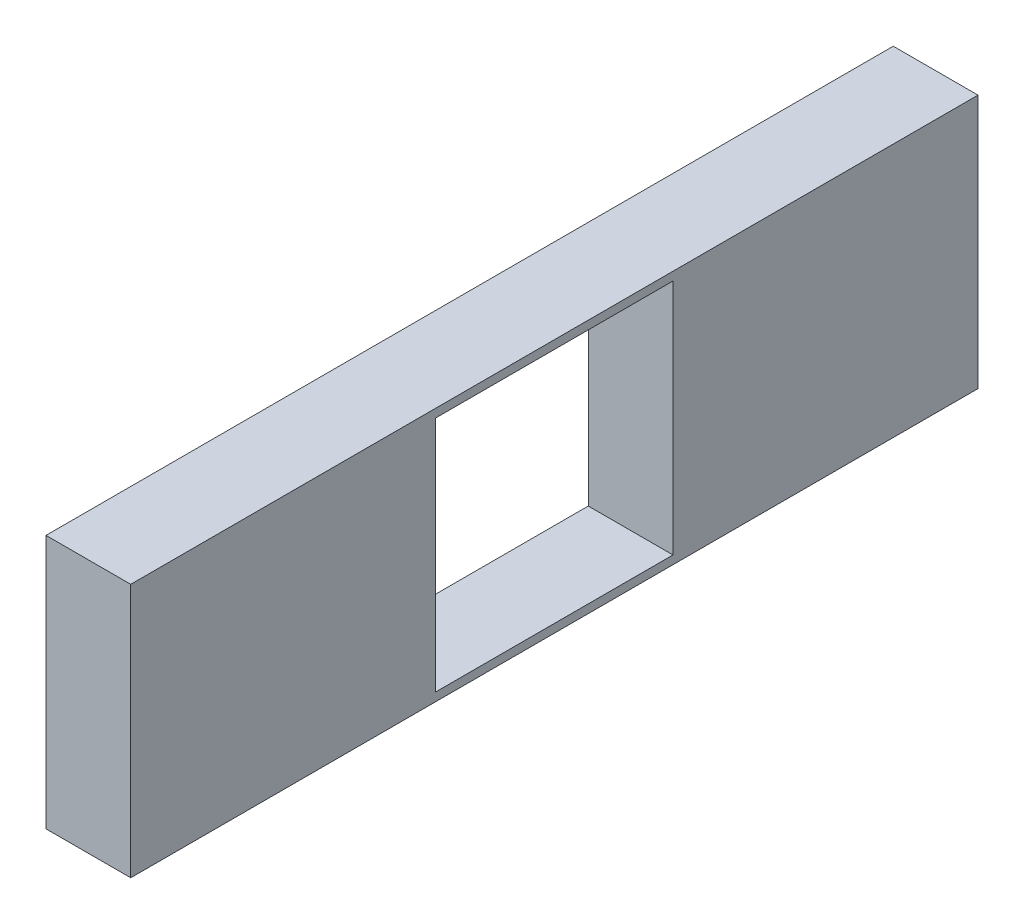
ISO-10303-21;
HEADER;
FILE_DESCRIPTION(('STEP AP214'),'2;1');
FILE_NAME('part.step','',(''),(''),'','','');
FILE_SCHEMA(('AUTOMOTIVE_DESIGN { 1 0 10303 214 1 1 1 1 }'));
ENDSEC;
DATA;
#1=APPLICATION_CONTEXT('core data for automotive mechanical design processes');
#2=APPLICATION_PROTOCOL_DEFINITION('international standard','automotive_design',2000,#1);
#3=PRODUCT_CONTEXT('',#1,'mechanical');
#4=PRODUCT('Part','Part','',(#3));
#5=PRODUCT_RELATED_PRODUCT_CATEGORY('part','',(#4));
#6=PRODUCT_DEFINITION_FORMATION('','',#4);
#7=PRODUCT_DEFINITION_CONTEXT('part definition',#1,'design');
#8=PRODUCT_DEFINITION('design','',#6,#7);
#9=PRODUCT_DEFINITION_SHAPE('','',#8);
#10=(LENGTH_UNIT() NAMED_UNIT(*) SI_UNIT(.MILLI.,.METRE.));
#11=(NAMED_UNIT(*) PLANE_ANGLE_UNIT() SI_UNIT($,.RADIAN.));
#12=(NAMED_UNIT(*) SI_UNIT($,.STERADIAN.) SOLID_ANGLE_UNIT());
#13=UNCERTAINTY_MEASURE_WITH_UNIT(LENGTH_MEASURE(1.E-05),#10,'distance_accuracy_value','');
#14=(GEOMETRIC_REPRESENTATION_CONTEXT(3) GLOBAL_UNCERTAINTY_ASSIGNED_CONTEXT((#13)) GLOBAL_UNIT_ASSIGNED_CONTEXT((#10,
#11,#12)) REPRESENTATION_CONTEXT('',''));
#15=CARTESIAN_POINT('',(0.,0.,0.));
#16=DIRECTION('',(0.,0.,1.));
#17=DIRECTION('',(1.,0.,0.));
#18=AXIS2_PLACEMENT_3D('',#15,#16,#17);
#19=CARTESIAN_POINT('',(5.,0.,0.));
#20=DIRECTION('',(0.,1.,0.));
#21=DIRECTION('',(0.,0.,1.));
#22=AXIS2_PLACEMENT_3D('',#19,#20,#21);
#23=PLANE('',#22);
#24=DIRECTION('',(0.,0.,-1.));
#25=VECTOR('',#24,1.);
#26=CARTESIAN_POINT('',(0.,0.,0.));
#27=LINE('',#26,#25);
#28=CARTESIAN_POINT('',(0.,0.,0.));
#29=VERTEX_POINT('',#28);
#30=CARTESIAN_POINT('',(0.,0.,-50.));
#31=VERTEX_POINT('',#30);
#32=EDGE_CURVE('E142',#29,#31,#27,.T.);
#33=ORIENTED_EDGE('',*,*,#32,.T.);
#34=DIRECTION('',(-1.,0.,0.));
#35=VECTOR('',#34,1.);
#36=CARTESIAN_POINT('',(5.,0.,-50.));
#37=LINE('',#36,#35);
#38=CARTESIAN_POINT('',(5.,0.,-50.));
#39=VERTEX_POINT('',#38);
#40=EDGE_CURVE('E11',#39,#31,#37,.T.);
#41=ORIENTED_EDGE('',*,*,#40,.F.);
#42=DIRECTION('',(0.,0.,-1.));
#43=VECTOR('',#42,1.);
#44=CARTESIAN_POINT('',(5.,0.,0.));
#45=LINE('',#44,#43);
#46=CARTESIAN_POINT('',(5.,0.,0.));
#47=VERTEX_POINT('',#46);
#48=EDGE_CURVE('E114',#47,#39,#45,.T.);
#49=ORIENTED_EDGE('',*,*,#48,.F.);
#50=DIRECTION('',(-1.,0.,0.));
#51=VECTOR('',#50,1.);
#52=CARTESIAN_POINT('',(5.,0.,0.));
#53=LINE('',#52,#51);
#54=EDGE_CURVE('E54',#47,#29,#53,.T.);
#55=ORIENTED_EDGE('',*,*,#54,.T.);
#56=EDGE_LOOP('',(#33,#41,#49,#55));
#57=FACE_BOUND('',#56,.T.);
#58=ADVANCED_FACE('F35',(#57),#23,.F.);
#59=CARTESIAN_POINT('',(5.,0.,-50.));
#60=DIRECTION('',(0.,0.,1.));
#61=DIRECTION('',(0.,-1.,0.));
#62=AXIS2_PLACEMENT_3D('',#59,#60,#61);
#63=PLANE('',#62);
#64=DIRECTION('',(0.,1.,0.));
#65=VECTOR('',#64,1.);
#66=CARTESIAN_POINT('',(0.,0.,-50.));
#67=LINE('',#66,#65);
#68=CARTESIAN_POINT('',(0.,15.,-50.));
#69=VERTEX_POINT('',#68);
#70=EDGE_CURVE('E120',#31,#69,#67,.T.);
#71=ORIENTED_EDGE('',*,*,#70,.T.);
#72=DIRECTION('',(-1.,0.,0.));
#73=VECTOR('',#72,1.);
#74=CARTESIAN_POINT('',(5.,15.,-50.));
#75=LINE('',#74,#73);
#76=CARTESIAN_POINT('',(5.,15.,-50.));
#77=VERTEX_POINT('',#76);
#78=EDGE_CURVE('E45',#77,#69,#75,.T.);
#79=ORIENTED_EDGE('',*,*,#78,.F.);
#80=DIRECTION('',(0.,1.,0.));
#81=VECTOR('',#80,1.);
#82=CARTESIAN_POINT('',(5.,0.,-50.));
#83=LINE('',#82,#81);
#84=EDGE_CURVE('E108',#39,#77,#83,.T.);
#85=ORIENTED_EDGE('',*,*,#84,.F.);
#86=ORIENTED_EDGE('',*,*,#40,.T.);
#87=EDGE_LOOP('',(#71,#79,#85,#86));
#88=FACE_BOUND('',#87,.T.);
#89=ADVANCED_FACE('F119',(#88),#63,.F.);
#90=CARTESIAN_POINT('',(5.,15.,0.));
#91=DIRECTION('',(0.,1.,0.));
#92=DIRECTION('',(0.,0.,1.));
#93=AXIS2_PLACEMENT_3D('',#90,#91,#92);
#94=PLANE('',#93);
#95=DIRECTION('',(0.,0.,-1.));
#96=VECTOR('',#95,1.);
#97=CARTESIAN_POINT('',(0.,15.,0.));
#98=LINE('',#97,#96);
#99=CARTESIAN_POINT('',(0.,15.,0.));
#100=VERTEX_POINT('',#99);
#101=EDGE_CURVE('E145',#100,#69,#98,.T.);
#102=ORIENTED_EDGE('',*,*,#101,.F.);
#103=DIRECTION('',(-1.,0.,0.));
#104=VECTOR('',#103,1.);
#105=CARTESIAN_POINT('',(5.,15.,0.));
#106=LINE('',#105,#104);
#107=CARTESIAN_POINT('',(5.,15.,0.));
#108=VERTEX_POINT('',#107);
#109=EDGE_CURVE('E80',#108,#100,#106,.T.);
#110=ORIENTED_EDGE('',*,*,#109,.F.);
#111=DIRECTION('',(0.,0.,-1.));
#112=VECTOR('',#111,1.);
#113=CARTESIAN_POINT('',(5.,15.,0.));
#114=LINE('',#113,#112);
#115=EDGE_CURVE('E113',#108,#77,#114,.T.);
#116=ORIENTED_EDGE('',*,*,#115,.T.);
#117=ORIENTED_EDGE('',*,*,#78,.T.);
#118=EDGE_LOOP('',(#102,#110,#116,#117));
#119=FACE_BOUND('',#118,.T.);
#120=ADVANCED_FACE('F124',(#119),#94,.T.);
#121=CARTESIAN_POINT('',(5.,0.,-18.));
#122=DIRECTION('',(0.,0.,-1.));
#123=DIRECTION('',(0.,1.,0.));
#124=AXIS2_PLACEMENT_3D('',#121,#122,#123);
#125=PLANE('',#124);
#126=DIRECTION('',(0.,-1.,0.));
#127=VECTOR('',#126,1.);
#128=CARTESIAN_POINT('',(0.,0.,-18.));
#129=LINE('',#128,#127);
#130=CARTESIAN_POINT('',(0.,14.5,-18.));
#131=VERTEX_POINT('',#130);
#132=CARTESIAN_POINT('',(0.,0.499999999999998,-18.));
#133=VERTEX_POINT('',#132);
#134=EDGE_CURVE('E131',#131,#133,#129,.T.);
#135=ORIENTED_EDGE('',*,*,#134,.F.);
#136=DIRECTION('',(-1.,0.,0.));
#137=VECTOR('',#136,1.);
#138=CARTESIAN_POINT('',(5.,14.5,-18.));
#139=LINE('',#138,#137);
#140=CARTESIAN_POINT('',(5.,14.5,-18.));
#141=VERTEX_POINT('',#140);
#142=EDGE_CURVE('E39',#141,#131,#139,.T.);
#143=ORIENTED_EDGE('',*,*,#142,.F.);
#144=DIRECTION('',(0.,-1.,0.));
#145=VECTOR('',#144,1.);
#146=CARTESIAN_POINT('',(5.,0.,-18.));
#147=LINE('',#146,#145);
#148=CARTESIAN_POINT('',(5.,0.499999999999998,-18.));
#149=VERTEX_POINT('',#148);
#150=EDGE_CURVE('E150',#141,#149,#147,.T.);
#151=ORIENTED_EDGE('',*,*,#150,.T.);
#152=DIRECTION('',(-1.,0.,0.));
#153=VECTOR('',#152,1.);
#154=CARTESIAN_POINT('',(5.,0.499999999999998,-18.));
#155=LINE('',#154,#153);
#156=EDGE_CURVE('E127',#149,#133,#155,.T.);
#157=ORIENTED_EDGE('',*,*,#156,.T.);
#158=EDGE_LOOP('',(#135,#143,#151,#157));
#159=FACE_BOUND('',#158,.T.);
#160=ADVANCED_FACE('F37',(#159),#125,.T.);
#161=CARTESIAN_POINT('',(5.,14.5,0.));
#162=DIRECTION('',(0.,-1.,0.));
#163=DIRECTION('',(0.,0.,-1.));
#164=AXIS2_PLACEMENT_3D('',#161,#162,#163);
#165=PLANE('',#164);
#166=DIRECTION('',(0.,0.,1.));
#167=VECTOR('',#166,1.);
#168=CARTESIAN_POINT('',(0.,14.5,0.));
#169=LINE('',#168,#167);
#170=CARTESIAN_POINT('',(0.,14.5,-32.));
#171=VERTEX_POINT('',#170);
#172=EDGE_CURVE('E134',#171,#131,#169,.T.);
#173=ORIENTED_EDGE('',*,*,#172,.F.);
#174=DIRECTION('',(-1.,0.,0.));
#175=VECTOR('',#174,1.);
#176=CARTESIAN_POINT('',(5.,14.5,-32.));
#177=LINE('',#176,#175);
#178=CARTESIAN_POINT('',(5.,14.5,-32.));
#179=VERTEX_POINT('',#178);
#180=EDGE_CURVE('E156',#179,#171,#177,.T.);
#181=ORIENTED_EDGE('',*,*,#180,.F.);
#182=DIRECTION('',(0.,0.,1.));
#183=VECTOR('',#182,1.);
#184=CARTESIAN_POINT('',(5.,14.5,0.));
#185=LINE('',#184,#183);
#186=EDGE_CURVE('E165',#179,#141,#185,.T.);
#187=ORIENTED_EDGE('',*,*,#186,.T.);
#188=ORIENTED_EDGE('',*,*,#142,.T.);
#189=EDGE_LOOP('',(#173,#181,#187,#188));
#190=FACE_BOUND('',#189,.T.);
#191=ADVANCED_FACE('F163',(#190),#165,.T.);
#192=CARTESIAN_POINT('',(5.,0.,-32.));
#193=DIRECTION('',(0.,0.,-1.));
#194=DIRECTION('',(-1.,0.,0.));
#195=AXIS2_PLACEMENT_3D('',#192,#193,#194);
#196=PLANE('',#195);
#197=DIRECTION('',(0.,-1.,0.));
#198=VECTOR('',#197,1.);
#199=CARTESIAN_POINT('',(0.,0.,-32.));
#200=LINE('',#199,#198);
#201=CARTESIAN_POINT('',(0.,0.5,-32.));
#202=VERTEX_POINT('',#201);
#203=EDGE_CURVE('E137',#171,#202,#200,.T.);
#204=ORIENTED_EDGE('',*,*,#203,.T.);
#205=DIRECTION('',(-1.,0.,0.));
#206=VECTOR('',#205,1.);
#207=CARTESIAN_POINT('',(5.,0.5,-32.));
#208=LINE('',#207,#206);
#209=CARTESIAN_POINT('',(5.,0.5,-32.));
#210=VERTEX_POINT('',#209);
#211=EDGE_CURVE('E154',#210,#202,#208,.T.);
#212=ORIENTED_EDGE('',*,*,#211,.F.);
#213=DIRECTION('',(0.,-1.,0.));
#214=VECTOR('',#213,1.);
#215=CARTESIAN_POINT('',(5.,0.,-32.));
#216=LINE('',#215,#214);
#217=EDGE_CURVE('E178',#179,#210,#216,.T.);
#218=ORIENTED_EDGE('',*,*,#217,.F.);
#219=ORIENTED_EDGE('',*,*,#180,.T.);
#220=EDGE_LOOP('',(#204,#212,#218,#219));
#221=FACE_BOUND('',#220,.T.);
#222=ADVANCED_FACE('F172',(#221),#196,.F.);
#223=CARTESIAN_POINT('',(5.,0.499999999999996,0.));
#224=DIRECTION('',(0.,-1.,0.));
#225=DIRECTION('',(0.,0.,-1.));
#226=AXIS2_PLACEMENT_3D('',#223,#224,#225);
#227=PLANE('',#226);
#228=DIRECTION('',(0.,0.,1.));
#229=VECTOR('',#228,1.);
#230=CARTESIAN_POINT('',(0.,0.499999999999996,0.));
#231=LINE('',#230,#229);
#232=EDGE_CURVE('E139',#202,#133,#231,.T.);
#233=ORIENTED_EDGE('',*,*,#232,.T.);
#234=ORIENTED_EDGE('',*,*,#156,.F.);
#235=DIRECTION('',(0.,0.,1.));
#236=VECTOR('',#235,1.);
#237=CARTESIAN_POINT('',(5.,0.499999999999996,0.));
#238=LINE('',#237,#236);
#239=EDGE_CURVE('E176',#210,#149,#238,.T.);
#240=ORIENTED_EDGE('',*,*,#239,.F.);
#241=ORIENTED_EDGE('',*,*,#211,.T.);
#242=EDGE_LOOP('',(#233,#234,#240,#241));
#243=FACE_BOUND('',#242,.T.);
#244=ADVANCED_FACE('F175',(#243),#227,.F.);
#245=CARTESIAN_POINT('',(5.,0.,0.));
#246=DIRECTION('',(0.,0.,1.));
#247=DIRECTION('',(0.,-1.,0.));
#248=AXIS2_PLACEMENT_3D('',#245,#246,#247);
#249=PLANE('',#248);
#250=DIRECTION('',(0.,1.,0.));
#251=VECTOR('',#250,1.);
#252=CARTESIAN_POINT('',(0.,0.,0.));
#253=LINE('',#252,#251);
#254=EDGE_CURVE('E147',#29,#100,#253,.T.);
#255=ORIENTED_EDGE('',*,*,#254,.F.);
#256=ORIENTED_EDGE('',*,*,#54,.F.);
#257=DIRECTION('',(0.,1.,0.));
#258=VECTOR('',#257,1.);
#259=CARTESIAN_POINT('',(5.,0.,0.));
#260=LINE('',#259,#258);
#261=EDGE_CURVE('E125',#47,#108,#260,.T.);
#262=ORIENTED_EDGE('',*,*,#261,.T.);
#263=ORIENTED_EDGE('',*,*,#109,.T.);
#264=EDGE_LOOP('',(#255,#256,#262,#263));
#265=FACE_BOUND('',#264,.T.);
#266=ADVANCED_FACE('F184',(#265),#249,.T.);
#267=CARTESIAN_POINT('',(5.,0.,0.));
#268=DIRECTION('',(1.,0.,0.));
#269=DIRECTION('',(0.,0.,-1.));
#270=AXIS2_PLACEMENT_3D('',#267,#268,#269);
#271=PLANE('',#270);
#272=ORIENTED_EDGE('',*,*,#150,.F.);
#273=ORIENTED_EDGE('',*,*,#186,.F.);
#274=ORIENTED_EDGE('',*,*,#217,.T.);
#275=ORIENTED_EDGE('',*,*,#239,.T.);
#276=EDGE_LOOP('',(#272,#273,#274,#275));
#277=FACE_BOUND('',#276,.T.);
#278=ORIENTED_EDGE('',*,*,#48,.T.);
#279=ORIENTED_EDGE('',*,*,#84,.T.);
#280=ORIENTED_EDGE('',*,*,#115,.F.);
#281=ORIENTED_EDGE('',*,*,#261,.F.);
#282=EDGE_LOOP('',(#278,#279,#280,#281));
#283=FACE_BOUND('',#282,.T.);
#284=ADVANCED_FACE('F110',(#277,#283),#271,.T.);
#285=CARTESIAN_POINT('',(0.,0.,0.));
#286=DIRECTION('',(1.,0.,0.));
#287=DIRECTION('',(0.,0.,-1.));
#288=AXIS2_PLACEMENT_3D('',#285,#286,#287);
#289=PLANE('',#288);
#290=ORIENTED_EDGE('',*,*,#134,.T.);
#291=ORIENTED_EDGE('',*,*,#232,.F.);
#292=ORIENTED_EDGE('',*,*,#203,.F.);
#293=ORIENTED_EDGE('',*,*,#172,.T.);
#294=EDGE_LOOP('',(#290,#291,#292,#293));
#295=FACE_BOUND('',#294,.T.);
#296=ORIENTED_EDGE('',*,*,#32,.F.);
#297=ORIENTED_EDGE('',*,*,#254,.T.);
#298=ORIENTED_EDGE('',*,*,#101,.T.);
#299=ORIENTED_EDGE('',*,*,#70,.F.);
#300=EDGE_LOOP('',(#296,#297,#298,#299));
#301=FACE_BOUND('',#300,.T.);
#302=ADVANCED_FACE('F169',(#295,#301),#289,.F.);
#303=CLOSED_SHELL('',(#58,#89,#120,#160,#191,#222,#244,#266,#284,#302));
#304=MANIFOLD_SOLID_BREP('B2',#303);
#305=ADVANCED_BREP_SHAPE_REPRESENTATION('',(#18,#304),#14);
#306=SHAPE_DEFINITION_REPRESENTATION(#9,#305);
ENDSEC;
END-ISO-10303-21;
